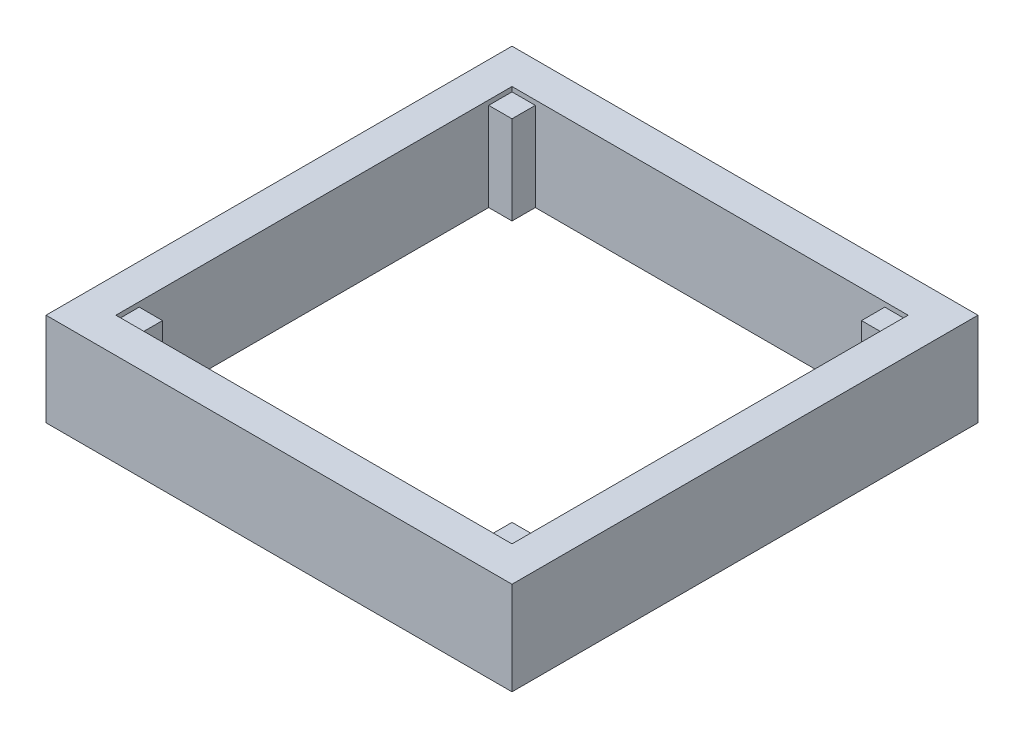
ISO-10303-21;
HEADER;
FILE_DESCRIPTION(('STEP AP214'),'2;1');
FILE_NAME('part.step','',(''),(''),'','','');
FILE_SCHEMA(('AUTOMOTIVE_DESIGN { 1 0 10303 214 1 1 1 1 }'));
ENDSEC;
DATA;
#1=APPLICATION_CONTEXT('core data for automotive mechanical design processes');
#2=APPLICATION_PROTOCOL_DEFINITION('international standard','automotive_design',2000,#1);
#3=PRODUCT_CONTEXT('',#1,'mechanical');
#4=PRODUCT('Part','Part','',(#3));
#5=PRODUCT_RELATED_PRODUCT_CATEGORY('part','',(#4));
#6=PRODUCT_DEFINITION_FORMATION('','',#4);
#7=PRODUCT_DEFINITION_CONTEXT('part definition',#1,'design');
#8=PRODUCT_DEFINITION('design','',#6,#7);
#9=PRODUCT_DEFINITION_SHAPE('','',#8);
#10=(LENGTH_UNIT() NAMED_UNIT(*) SI_UNIT(.MILLI.,.METRE.));
#11=(NAMED_UNIT(*) PLANE_ANGLE_UNIT() SI_UNIT($,.RADIAN.));
#12=(NAMED_UNIT(*) SI_UNIT($,.STERADIAN.) SOLID_ANGLE_UNIT());
#13=UNCERTAINTY_MEASURE_WITH_UNIT(LENGTH_MEASURE(1.E-05),#10,'distance_accuracy_value','');
#14=(GEOMETRIC_REPRESENTATION_CONTEXT(3) GLOBAL_UNCERTAINTY_ASSIGNED_CONTEXT((#13)) GLOBAL_UNIT_ASSIGNED_CONTEXT((#10,
#11,#12)) REPRESENTATION_CONTEXT('',''));
#15=CARTESIAN_POINT('',(0.,0.,0.));
#16=DIRECTION('',(0.,0.,1.));
#17=DIRECTION('',(1.,0.,0.));
#18=AXIS2_PLACEMENT_3D('',#15,#16,#17);
#19=CARTESIAN_POINT('',(107.95,50.8,-107.95));
#20=DIRECTION('',(-1.,0.,0.));
#21=DIRECTION('',(0.,0.,1.));
#22=AXIS2_PLACEMENT_3D('',#19,#20,#21);
#23=PLANE('',#22);
#24=DIRECTION('',(0.,0.,-1.));
#25=VECTOR('',#24,1.);
#26=CARTESIAN_POINT('',(107.95,48.26,-95.25));
#27=LINE('',#26,#25);
#28=CARTESIAN_POINT('',(107.95,48.26,-95.25));
#29=VERTEX_POINT('',#28);
#30=CARTESIAN_POINT('',(107.95,48.26,-107.95));
#31=VERTEX_POINT('',#30);
#32=EDGE_CURVE('E52',#29,#31,#27,.T.);
#33=ORIENTED_EDGE('',*,*,#32,.F.);
#34=DIRECTION('',(0.,-1.,0.));
#35=VECTOR('',#34,1.);
#36=CARTESIAN_POINT('',(107.95,68.7605122421383,-95.25));
#37=LINE('',#36,#35);
#38=CARTESIAN_POINT('',(107.95,0.,-95.25));
#39=VERTEX_POINT('',#38);
#40=EDGE_CURVE('E56',#29,#39,#37,.T.);
#41=ORIENTED_EDGE('',*,*,#40,.T.);
#42=DIRECTION('',(0.,0.,-1.));
#43=VECTOR('',#42,1.);
#44=CARTESIAN_POINT('',(107.95,0.,-107.95));
#45=LINE('',#44,#43);
#46=CARTESIAN_POINT('',(107.95,0.,95.25));
#47=VERTEX_POINT('',#46);
#48=EDGE_CURVE('E265',#47,#39,#45,.T.);
#49=ORIENTED_EDGE('',*,*,#48,.F.);
#50=DIRECTION('',(0.,-1.,0.));
#51=VECTOR('',#50,1.);
#52=CARTESIAN_POINT('',(107.95,68.7605122421383,95.25));
#53=LINE('',#52,#51);
#54=CARTESIAN_POINT('',(107.95,48.26,95.25));
#55=VERTEX_POINT('',#54);
#56=EDGE_CURVE('E251',#55,#47,#53,.T.);
#57=ORIENTED_EDGE('',*,*,#56,.F.);
#58=DIRECTION('',(0.,0.,1.));
#59=VECTOR('',#58,1.);
#60=CARTESIAN_POINT('',(107.95,48.26,95.25));
#61=LINE('',#60,#59);
#62=CARTESIAN_POINT('',(107.95,48.26,107.95));
#63=VERTEX_POINT('',#62);
#64=EDGE_CURVE('E259',#55,#63,#61,.T.);
#65=ORIENTED_EDGE('',*,*,#64,.T.);
#66=DIRECTION('',(0.,-1.,0.));
#67=VECTOR('',#66,1.);
#68=CARTESIAN_POINT('',(107.95,50.8,107.95));
#69=LINE('',#68,#67);
#70=CARTESIAN_POINT('',(107.95,50.8,107.95));
#71=VERTEX_POINT('',#70);
#72=EDGE_CURVE('E269',#71,#63,#69,.T.);
#73=ORIENTED_EDGE('',*,*,#72,.F.);
#74=DIRECTION('',(0.,0.,-1.));
#75=VECTOR('',#74,1.);
#76=CARTESIAN_POINT('',(107.95,50.8,-107.95));
#77=LINE('',#76,#75);
#78=CARTESIAN_POINT('',(107.95,50.8,-107.95));
#79=VERTEX_POINT('',#78);
#80=EDGE_CURVE('E266',#71,#79,#77,.T.);
#81=ORIENTED_EDGE('',*,*,#80,.T.);
#82=DIRECTION('',(0.,-1.,0.));
#83=VECTOR('',#82,1.);
#84=CARTESIAN_POINT('',(107.95,50.8,-107.95));
#85=LINE('',#84,#83);
#86=EDGE_CURVE('E273',#79,#31,#85,.T.);
#87=ORIENTED_EDGE('',*,*,#86,.T.);
#88=EDGE_LOOP('',(#33,#41,#49,#57,#65,#73,#81,#87));
#89=FACE_BOUND('',#88,.T.);
#90=ADVANCED_FACE('F34',(#89),#23,.T.);
#91=CARTESIAN_POINT('',(-127.,305.513373225671,-107.95));
#92=DIRECTION('',(0.,0.,1.));
#93=DIRECTION('',(1.,0.,0.));
#94=AXIS2_PLACEMENT_3D('',#91,#92,#93);
#95=PLANE('',#94);
#96=DIRECTION('',(-1.,0.,0.));
#97=VECTOR('',#96,1.);
#98=CARTESIAN_POINT('',(-127.,0.,-107.95));
#99=LINE('',#98,#97);
#100=CARTESIAN_POINT('',(95.25,0.,-107.95));
#101=VERTEX_POINT('',#100);
#102=CARTESIAN_POINT('',(-95.25,0.,-107.95));
#103=VERTEX_POINT('',#102);
#104=EDGE_CURVE('E228',#101,#103,#99,.T.);
#105=ORIENTED_EDGE('',*,*,#104,.F.);
#106=DIRECTION('',(0.,-1.,0.));
#107=VECTOR('',#106,1.);
#108=CARTESIAN_POINT('',(95.25,68.7605122421383,-107.95));
#109=LINE('',#108,#107);
#110=CARTESIAN_POINT('',(95.25,48.26,-107.95));
#111=VERTEX_POINT('',#110);
#112=EDGE_CURVE('E199',#111,#101,#109,.T.);
#113=ORIENTED_EDGE('',*,*,#112,.F.);
#114=DIRECTION('',(-1.,0.,0.));
#115=VECTOR('',#114,1.);
#116=CARTESIAN_POINT('',(95.25,48.26,-107.95));
#117=LINE('',#116,#115);
#118=EDGE_CURVE('E193',#31,#111,#117,.T.);
#119=ORIENTED_EDGE('',*,*,#118,.F.);
#120=ORIENTED_EDGE('',*,*,#86,.F.);
#121=DIRECTION('',(-1.,0.,0.));
#122=VECTOR('',#121,1.);
#123=CARTESIAN_POINT('',(-127.,50.8,-107.95));
#124=LINE('',#123,#122);
#125=CARTESIAN_POINT('',(-107.95,50.8,-107.95));
#126=VERTEX_POINT('',#125);
#127=EDGE_CURVE('E234',#79,#126,#124,.T.);
#128=ORIENTED_EDGE('',*,*,#127,.T.);
#129=DIRECTION('',(0.,-1.,0.));
#130=VECTOR('',#129,1.);
#131=CARTESIAN_POINT('',(-107.95,50.8,-107.95));
#132=LINE('',#131,#130);
#133=CARTESIAN_POINT('',(-107.95,48.26,-107.95));
#134=VERTEX_POINT('',#133);
#135=EDGE_CURVE('E44',#126,#134,#132,.T.);
#136=ORIENTED_EDGE('',*,*,#135,.T.);
#137=DIRECTION('',(1.,0.,0.));
#138=VECTOR('',#137,1.);
#139=CARTESIAN_POINT('',(-95.25,48.26,-107.95));
#140=LINE('',#139,#138);
#141=CARTESIAN_POINT('',(-95.25,48.26,-107.95));
#142=VERTEX_POINT('',#141);
#143=EDGE_CURVE('E216',#134,#142,#140,.T.);
#144=ORIENTED_EDGE('',*,*,#143,.T.);
#145=DIRECTION('',(0.,-1.,0.));
#146=VECTOR('',#145,1.);
#147=CARTESIAN_POINT('',(-95.25,68.7605122421383,-107.95));
#148=LINE('',#147,#146);
#149=EDGE_CURVE('E215',#142,#103,#148,.T.);
#150=ORIENTED_EDGE('',*,*,#149,.T.);
#151=EDGE_LOOP('',(#105,#113,#119,#120,#128,#136,#144,#150));
#152=FACE_BOUND('',#151,.T.);
#153=ADVANCED_FACE('F368',(#152),#95,.T.);
#154=CARTESIAN_POINT('',(-107.95,50.8,-107.95));
#155=DIRECTION('',(-1.,0.,0.));
#156=DIRECTION('',(0.,0.,1.));
#157=AXIS2_PLACEMENT_3D('',#154,#155,#156);
#158=PLANE('',#157);
#159=DIRECTION('',(0.,-1.,0.));
#160=VECTOR('',#159,1.);
#161=CARTESIAN_POINT('',(-107.95,68.7605122421383,-95.25));
#162=LINE('',#161,#160);
#163=CARTESIAN_POINT('',(-107.95,48.26,-95.25));
#164=VERTEX_POINT('',#163);
#165=CARTESIAN_POINT('',(-107.95,0.,-95.25));
#166=VERTEX_POINT('',#165);
#167=EDGE_CURVE('E210',#164,#166,#162,.T.);
#168=ORIENTED_EDGE('',*,*,#167,.F.);
#169=DIRECTION('',(0.,0.,-1.));
#170=VECTOR('',#169,1.);
#171=CARTESIAN_POINT('',(-107.95,48.26,-95.25));
#172=LINE('',#171,#170);
#173=EDGE_CURVE('E218',#164,#134,#172,.T.);
#174=ORIENTED_EDGE('',*,*,#173,.T.);
#175=ORIENTED_EDGE('',*,*,#135,.F.);
#176=DIRECTION('',(0.,0.,-1.));
#177=VECTOR('',#176,1.);
#178=CARTESIAN_POINT('',(-107.95,50.8,-107.95));
#179=LINE('',#178,#177);
#180=CARTESIAN_POINT('',(-107.95,50.8,107.95));
#181=VERTEX_POINT('',#180);
#182=EDGE_CURVE('E326',#181,#126,#179,.T.);
#183=ORIENTED_EDGE('',*,*,#182,.F.);
#184=DIRECTION('',(0.,-1.,0.));
#185=VECTOR('',#184,1.);
#186=CARTESIAN_POINT('',(-107.95,50.8,107.95));
#187=LINE('',#186,#185);
#188=CARTESIAN_POINT('',(-107.95,48.26,107.95));
#189=VERTEX_POINT('',#188);
#190=EDGE_CURVE('E12',#181,#189,#187,.T.);
#191=ORIENTED_EDGE('',*,*,#190,.T.);
#192=DIRECTION('',(0.,0.,1.));
#193=VECTOR('',#192,1.);
#194=CARTESIAN_POINT('',(-107.95,48.26,95.25));
#195=LINE('',#194,#193);
#196=CARTESIAN_POINT('',(-107.95,48.26,95.25));
#197=VERTEX_POINT('',#196);
#198=EDGE_CURVE('E283',#197,#189,#195,.T.);
#199=ORIENTED_EDGE('',*,*,#198,.F.);
#200=DIRECTION('',(0.,-1.,0.));
#201=VECTOR('',#200,1.);
#202=CARTESIAN_POINT('',(-107.95,68.7605122421383,95.25));
#203=LINE('',#202,#201);
#204=CARTESIAN_POINT('',(-107.95,0.,95.25));
#205=VERTEX_POINT('',#204);
#206=EDGE_CURVE('E278',#197,#205,#203,.T.);
#207=ORIENTED_EDGE('',*,*,#206,.T.);
#208=DIRECTION('',(0.,0.,-1.));
#209=VECTOR('',#208,1.);
#210=CARTESIAN_POINT('',(-107.95,0.,-107.95));
#211=LINE('',#210,#209);
#212=EDGE_CURVE('E318',#205,#166,#211,.T.);
#213=ORIENTED_EDGE('',*,*,#212,.T.);
#214=EDGE_LOOP('',(#168,#174,#175,#183,#191,#199,#207,#213));
#215=FACE_BOUND('',#214,.T.);
#216=ADVANCED_FACE('F373',(#215),#158,.F.);
#217=CARTESIAN_POINT('',(-127.,305.513373225671,107.95));
#218=DIRECTION('',(0.,0.,1.));
#219=DIRECTION('',(1.,0.,0.));
#220=AXIS2_PLACEMENT_3D('',#217,#218,#219);
#221=PLANE('',#220);
#222=ORIENTED_EDGE('',*,*,#72,.T.);
#223=DIRECTION('',(-1.,0.,0.));
#224=VECTOR('',#223,1.);
#225=CARTESIAN_POINT('',(95.25,48.26,107.95));
#226=LINE('',#225,#224);
#227=CARTESIAN_POINT('',(95.25,48.26,107.95));
#228=VERTEX_POINT('',#227);
#229=EDGE_CURVE('E257',#63,#228,#226,.T.);
#230=ORIENTED_EDGE('',*,*,#229,.T.);
#231=DIRECTION('',(0.,-1.,0.));
#232=VECTOR('',#231,1.);
#233=CARTESIAN_POINT('',(95.25,68.7605122421383,107.95));
#234=LINE('',#233,#232);
#235=CARTESIAN_POINT('',(95.25,0.,107.95));
#236=VERTEX_POINT('',#235);
#237=EDGE_CURVE('E256',#228,#236,#234,.T.);
#238=ORIENTED_EDGE('',*,*,#237,.T.);
#239=DIRECTION('',(-1.,0.,0.));
#240=VECTOR('',#239,1.);
#241=CARTESIAN_POINT('',(-127.,0.,107.95));
#242=LINE('',#241,#240);
#243=CARTESIAN_POINT('',(-95.25,0.,107.95));
#244=VERTEX_POINT('',#243);
#245=EDGE_CURVE('E38',#236,#244,#242,.T.);
#246=ORIENTED_EDGE('',*,*,#245,.T.);
#247=DIRECTION('',(0.,-1.,0.));
#248=VECTOR('',#247,1.);
#249=CARTESIAN_POINT('',(-95.25,68.7605122421383,107.95));
#250=LINE('',#249,#248);
#251=CARTESIAN_POINT('',(-95.25,48.26,107.95));
#252=VERTEX_POINT('',#251);
#253=EDGE_CURVE('E275',#252,#244,#250,.T.);
#254=ORIENTED_EDGE('',*,*,#253,.F.);
#255=DIRECTION('',(1.,0.,0.));
#256=VECTOR('',#255,1.);
#257=CARTESIAN_POINT('',(-95.25,48.26,107.95));
#258=LINE('',#257,#256);
#259=EDGE_CURVE('E292',#189,#252,#258,.T.);
#260=ORIENTED_EDGE('',*,*,#259,.F.);
#261=ORIENTED_EDGE('',*,*,#190,.F.);
#262=DIRECTION('',(-1.,0.,0.));
#263=VECTOR('',#262,1.);
#264=CARTESIAN_POINT('',(-127.,50.8,107.95));
#265=LINE('',#264,#263);
#266=EDGE_CURVE('E313',#71,#181,#265,.T.);
#267=ORIENTED_EDGE('',*,*,#266,.F.);
#268=EDGE_LOOP('',(#222,#230,#238,#246,#254,#260,#261,#267));
#269=FACE_BOUND('',#268,.T.);
#270=ADVANCED_FACE('F365',(#269),#221,.F.);
#271=CARTESIAN_POINT('',(-127.,50.8,-107.95));
#272=DIRECTION('',(1.,0.,0.));
#273=DIRECTION('',(0.,0.,-1.));
#274=AXIS2_PLACEMENT_3D('',#271,#272,#273);
#275=PLANE('',#274);
#276=DIRECTION('',(0.,0.,1.));
#277=VECTOR('',#276,1.);
#278=CARTESIAN_POINT('',(-127.,0.,-107.95));
#279=LINE('',#278,#277);
#280=CARTESIAN_POINT('',(-127.,0.,-127.));
#281=VERTEX_POINT('',#280);
#282=CARTESIAN_POINT('',(-127.,0.,127.));
#283=VERTEX_POINT('',#282);
#284=EDGE_CURVE('E309',#281,#283,#279,.T.);
#285=ORIENTED_EDGE('',*,*,#284,.T.);
#286=DIRECTION('',(0.,-1.,0.));
#287=VECTOR('',#286,1.);
#288=CARTESIAN_POINT('',(-127.,305.513373225671,127.));
#289=LINE('',#288,#287);
#290=CARTESIAN_POINT('',(-127.,50.8,127.));
#291=VERTEX_POINT('',#290);
#292=EDGE_CURVE('E285',#291,#283,#289,.T.);
#293=ORIENTED_EDGE('',*,*,#292,.F.);
#294=DIRECTION('',(0.,0.,1.));
#295=VECTOR('',#294,1.);
#296=CARTESIAN_POINT('',(-127.,50.8,-107.95));
#297=LINE('',#296,#295);
#298=CARTESIAN_POINT('',(-127.,50.8,-127.));
#299=VERTEX_POINT('',#298);
#300=EDGE_CURVE('E321',#299,#291,#297,.T.);
#301=ORIENTED_EDGE('',*,*,#300,.F.);
#302=DIRECTION('',(0.,-1.,0.));
#303=VECTOR('',#302,1.);
#304=CARTESIAN_POINT('',(-127.,305.513373225671,-127.));
#305=LINE('',#304,#303);
#306=EDGE_CURVE('E237',#299,#281,#305,.T.);
#307=ORIENTED_EDGE('',*,*,#306,.T.);
#308=EDGE_LOOP('',(#285,#293,#301,#307));
#309=FACE_BOUND('',#308,.T.);
#310=ADVANCED_FACE('F36',(#309),#275,.F.);
#311=CARTESIAN_POINT('',(0.,50.8,0.));
#312=DIRECTION('',(0.,1.,0.));
#313=DIRECTION('',(0.,0.,1.));
#314=AXIS2_PLACEMENT_3D('',#311,#312,#313);
#315=PLANE('',#314);
#316=ORIENTED_EDGE('',*,*,#266,.T.);
#317=ORIENTED_EDGE('',*,*,#182,.T.);
#318=ORIENTED_EDGE('',*,*,#127,.F.);
#319=ORIENTED_EDGE('',*,*,#80,.F.);
#320=EDGE_LOOP('',(#316,#317,#318,#319));
#321=FACE_BOUND('',#320,.T.);
#322=ORIENTED_EDGE('',*,*,#300,.T.);
#323=DIRECTION('',(1.,0.,0.));
#324=VECTOR('',#323,1.);
#325=CARTESIAN_POINT('',(-127.,50.8,127.));
#326=LINE('',#325,#324);
#327=CARTESIAN_POINT('',(127.,50.8,127.));
#328=VERTEX_POINT('',#327);
#329=EDGE_CURVE('E310',#291,#328,#326,.T.);
#330=ORIENTED_EDGE('',*,*,#329,.T.);
#331=DIRECTION('',(0.,0.,-1.));
#332=VECTOR('',#331,1.);
#333=CARTESIAN_POINT('',(127.,50.8,107.95));
#334=LINE('',#333,#332);
#335=CARTESIAN_POINT('',(127.,50.8,-127.));
#336=VERTEX_POINT('',#335);
#337=EDGE_CURVE('E307',#328,#336,#334,.T.);
#338=ORIENTED_EDGE('',*,*,#337,.T.);
#339=DIRECTION('',(1.,0.,0.));
#340=VECTOR('',#339,1.);
#341=CARTESIAN_POINT('',(-127.,50.8,-127.));
#342=LINE('',#341,#340);
#343=EDGE_CURVE('E230',#299,#336,#342,.T.);
#344=ORIENTED_EDGE('',*,*,#343,.F.);
#345=EDGE_LOOP('',(#322,#330,#338,#344));
#346=FACE_BOUND('',#345,.T.);
#347=ADVANCED_FACE('F356',(#321,#346),#315,.T.);
#348=CARTESIAN_POINT('',(0.,0.,0.));
#349=DIRECTION('',(0.,1.,0.));
#350=DIRECTION('',(0.,0.,1.));
#351=AXIS2_PLACEMENT_3D('',#348,#349,#350);
#352=PLANE('',#351);
#353=ORIENTED_EDGE('',*,*,#212,.F.);
#354=DIRECTION('',(-1.,0.,0.));
#355=VECTOR('',#354,1.);
#356=CARTESIAN_POINT('',(-95.25,0.,95.25));
#357=LINE('',#356,#355);
#358=CARTESIAN_POINT('',(-95.25,0.,95.25));
#359=VERTEX_POINT('',#358);
#360=EDGE_CURVE('E276',#359,#205,#357,.T.);
#361=ORIENTED_EDGE('',*,*,#360,.F.);
#362=DIRECTION('',(0.,0.,-1.));
#363=VECTOR('',#362,1.);
#364=CARTESIAN_POINT('',(-95.25,0.,95.25));
#365=LINE('',#364,#363);
#366=EDGE_CURVE('E280',#244,#359,#365,.T.);
#367=ORIENTED_EDGE('',*,*,#366,.F.);
#368=ORIENTED_EDGE('',*,*,#245,.F.);
#369=DIRECTION('',(0.,0.,-1.));
#370=VECTOR('',#369,1.);
#371=CARTESIAN_POINT('',(95.25,0.,95.25));
#372=LINE('',#371,#370);
#373=CARTESIAN_POINT('',(95.25,0.,95.25));
#374=VERTEX_POINT('',#373);
#375=EDGE_CURVE('E242',#236,#374,#372,.T.);
#376=ORIENTED_EDGE('',*,*,#375,.T.);
#377=DIRECTION('',(1.,0.,0.));
#378=VECTOR('',#377,1.);
#379=CARTESIAN_POINT('',(95.25,0.,95.25));
#380=LINE('',#379,#378);
#381=EDGE_CURVE('E243',#374,#47,#380,.T.);
#382=ORIENTED_EDGE('',*,*,#381,.T.);
#383=ORIENTED_EDGE('',*,*,#48,.T.);
#384=DIRECTION('',(1.,0.,0.));
#385=VECTOR('',#384,1.);
#386=CARTESIAN_POINT('',(95.25,0.,-95.25));
#387=LINE('',#386,#385);
#388=CARTESIAN_POINT('',(95.25,0.,-95.25));
#389=VERTEX_POINT('',#388);
#390=EDGE_CURVE('E190',#389,#39,#387,.T.);
#391=ORIENTED_EDGE('',*,*,#390,.F.);
#392=DIRECTION('',(0.,0.,1.));
#393=VECTOR('',#392,1.);
#394=CARTESIAN_POINT('',(95.25,0.,-95.25));
#395=LINE('',#394,#393);
#396=EDGE_CURVE('E189',#101,#389,#395,.T.);
#397=ORIENTED_EDGE('',*,*,#396,.F.);
#398=ORIENTED_EDGE('',*,*,#104,.T.);
#399=DIRECTION('',(0.,0.,1.));
#400=VECTOR('',#399,1.);
#401=CARTESIAN_POINT('',(-95.25,0.,-95.25));
#402=LINE('',#401,#400);
#403=CARTESIAN_POINT('',(-95.25,0.,-95.25));
#404=VERTEX_POINT('',#403);
#405=EDGE_CURVE('E205',#103,#404,#402,.T.);
#406=ORIENTED_EDGE('',*,*,#405,.T.);
#407=DIRECTION('',(-1.,0.,0.));
#408=VECTOR('',#407,1.);
#409=CARTESIAN_POINT('',(-95.25,0.,-95.25));
#410=LINE('',#409,#408);
#411=EDGE_CURVE('E201',#404,#166,#410,.T.);
#412=ORIENTED_EDGE('',*,*,#411,.T.);
#413=EDGE_LOOP('',(#353,#361,#367,#368,#376,#382,#383,#391,#397,#398,#406,#412));
#414=FACE_BOUND('',#413,.T.);
#415=DIRECTION('',(1.,0.,0.));
#416=VECTOR('',#415,1.);
#417=CARTESIAN_POINT('',(-127.,0.,127.));
#418=LINE('',#417,#416);
#419=CARTESIAN_POINT('',(127.,0.,127.));
#420=VERTEX_POINT('',#419);
#421=EDGE_CURVE('E304',#283,#420,#418,.T.);
#422=ORIENTED_EDGE('',*,*,#421,.F.);
#423=ORIENTED_EDGE('',*,*,#284,.F.);
#424=DIRECTION('',(1.,0.,0.));
#425=VECTOR('',#424,1.);
#426=CARTESIAN_POINT('',(-127.,0.,-127.));
#427=LINE('',#426,#425);
#428=CARTESIAN_POINT('',(127.,0.,-127.));
#429=VERTEX_POINT('',#428);
#430=EDGE_CURVE('E225',#281,#429,#427,.T.);
#431=ORIENTED_EDGE('',*,*,#430,.T.);
#432=DIRECTION('',(0.,0.,-1.));
#433=VECTOR('',#432,1.);
#434=CARTESIAN_POINT('',(127.,0.,107.95));
#435=LINE('',#434,#433);
#436=EDGE_CURVE('E301',#420,#429,#435,.T.);
#437=ORIENTED_EDGE('',*,*,#436,.F.);
#438=EDGE_LOOP('',(#422,#423,#431,#437));
#439=FACE_BOUND('',#438,.T.);
#440=ADVANCED_FACE('F350',(#414,#439),#352,.F.);
#441=CARTESIAN_POINT('',(-127.,305.513373225671,127.));
#442=DIRECTION('',(0.,0.,-1.));
#443=DIRECTION('',(-1.,0.,0.));
#444=AXIS2_PLACEMENT_3D('',#441,#442,#443);
#445=PLANE('',#444);
#446=ORIENTED_EDGE('',*,*,#329,.F.);
#447=ORIENTED_EDGE('',*,*,#292,.T.);
#448=ORIENTED_EDGE('',*,*,#421,.T.);
#449=DIRECTION('',(0.,-1.,0.));
#450=VECTOR('',#449,1.);
#451=CARTESIAN_POINT('',(127.,305.513373225671,127.));
#452=LINE('',#451,#450);
#453=EDGE_CURVE('E303',#328,#420,#452,.T.);
#454=ORIENTED_EDGE('',*,*,#453,.F.);
#455=EDGE_LOOP('',(#446,#447,#448,#454));
#456=FACE_BOUND('',#455,.T.);
#457=ADVANCED_FACE('F347',(#456),#445,.F.);
#458=CARTESIAN_POINT('',(127.,305.513373225671,107.95));
#459=DIRECTION('',(-1.,0.,0.));
#460=DIRECTION('',(0.,0.,1.));
#461=AXIS2_PLACEMENT_3D('',#458,#459,#460);
#462=PLANE('',#461);
#463=ORIENTED_EDGE('',*,*,#436,.T.);
#464=DIRECTION('',(0.,-1.,0.));
#465=VECTOR('',#464,1.);
#466=CARTESIAN_POINT('',(127.,305.513373225671,-127.));
#467=LINE('',#466,#465);
#468=EDGE_CURVE('E233',#336,#429,#467,.T.);
#469=ORIENTED_EDGE('',*,*,#468,.F.);
#470=ORIENTED_EDGE('',*,*,#337,.F.);
#471=ORIENTED_EDGE('',*,*,#453,.T.);
#472=EDGE_LOOP('',(#463,#469,#470,#471));
#473=FACE_BOUND('',#472,.T.);
#474=ADVANCED_FACE('F353',(#473),#462,.F.);
#475=CARTESIAN_POINT('',(-95.25,68.7605122421383,95.25));
#476=DIRECTION('',(-1.,0.,0.));
#477=DIRECTION('',(0.,0.,1.));
#478=AXIS2_PLACEMENT_3D('',#475,#476,#477);
#479=PLANE('',#478);
#480=DIRECTION('',(0.,0.,-1.));
#481=VECTOR('',#480,1.);
#482=CARTESIAN_POINT('',(-95.25,48.26,95.25));
#483=LINE('',#482,#481);
#484=CARTESIAN_POINT('',(-95.25,48.26,95.25));
#485=VERTEX_POINT('',#484);
#486=EDGE_CURVE('E289',#252,#485,#483,.T.);
#487=ORIENTED_EDGE('',*,*,#486,.F.);
#488=ORIENTED_EDGE('',*,*,#253,.T.);
#489=ORIENTED_EDGE('',*,*,#366,.T.);
#490=DIRECTION('',(0.,-1.,0.));
#491=VECTOR('',#490,1.);
#492=CARTESIAN_POINT('',(-95.25,68.7605122421383,95.25));
#493=LINE('',#492,#491);
#494=EDGE_CURVE('E279',#485,#359,#493,.T.);
#495=ORIENTED_EDGE('',*,*,#494,.F.);
#496=EDGE_LOOP('',(#487,#488,#489,#495));
#497=FACE_BOUND('',#496,.T.);
#498=ADVANCED_FACE('F384',(#497),#479,.F.);
#499=CARTESIAN_POINT('',(-95.25,68.7605122421383,95.25));
#500=DIRECTION('',(0.,0.,1.));
#501=DIRECTION('',(1.,0.,0.));
#502=AXIS2_PLACEMENT_3D('',#499,#500,#501);
#503=PLANE('',#502);
#504=DIRECTION('',(-1.,0.,0.));
#505=VECTOR('',#504,1.);
#506=CARTESIAN_POINT('',(-95.25,48.26,95.25));
#507=LINE('',#506,#505);
#508=EDGE_CURVE('E286',#485,#197,#507,.T.);
#509=ORIENTED_EDGE('',*,*,#508,.F.);
#510=ORIENTED_EDGE('',*,*,#494,.T.);
#511=ORIENTED_EDGE('',*,*,#360,.T.);
#512=ORIENTED_EDGE('',*,*,#206,.F.);
#513=EDGE_LOOP('',(#509,#510,#511,#512));
#514=FACE_BOUND('',#513,.T.);
#515=ADVANCED_FACE('F380',(#514),#503,.F.);
#516=CARTESIAN_POINT('',(0.,48.26,0.));
#517=DIRECTION('',(0.,1.,0.));
#518=DIRECTION('',(0.,0.,1.));
#519=AXIS2_PLACEMENT_3D('',#516,#517,#518);
#520=PLANE('',#519);
#521=ORIENTED_EDGE('',*,*,#259,.T.);
#522=ORIENTED_EDGE('',*,*,#486,.T.);
#523=ORIENTED_EDGE('',*,*,#508,.T.);
#524=ORIENTED_EDGE('',*,*,#198,.T.);
#525=EDGE_LOOP('',(#521,#522,#523,#524));
#526=FACE_BOUND('',#525,.T.);
#527=ADVANCED_FACE('F383',(#526),#520,.T.);
#528=CARTESIAN_POINT('',(0.,48.26,0.));
#529=DIRECTION('',(0.,1.,0.));
#530=DIRECTION('',(0.,0.,1.));
#531=AXIS2_PLACEMENT_3D('',#528,#529,#530);
#532=PLANE('',#531);
#533=DIRECTION('',(0.,0.,-1.));
#534=VECTOR('',#533,1.);
#535=CARTESIAN_POINT('',(95.25,48.26,95.25));
#536=LINE('',#535,#534);
#537=CARTESIAN_POINT('',(95.25,48.26,95.25));
#538=VERTEX_POINT('',#537);
#539=EDGE_CURVE('E252',#228,#538,#536,.T.);
#540=ORIENTED_EDGE('',*,*,#539,.F.);
#541=ORIENTED_EDGE('',*,*,#229,.F.);
#542=ORIENTED_EDGE('',*,*,#64,.F.);
#543=DIRECTION('',(1.,0.,0.));
#544=VECTOR('',#543,1.);
#545=CARTESIAN_POINT('',(95.25,48.26,95.25));
#546=LINE('',#545,#544);
#547=EDGE_CURVE('E246',#538,#55,#546,.T.);
#548=ORIENTED_EDGE('',*,*,#547,.F.);
#549=EDGE_LOOP('',(#540,#541,#542,#548));
#550=FACE_BOUND('',#549,.T.);
#551=ADVANCED_FACE('F378',(#550),#532,.T.);
#552=CARTESIAN_POINT('',(95.25,68.7605122421383,95.25));
#553=DIRECTION('',(0.,0.,-1.));
#554=DIRECTION('',(-1.,0.,0.));
#555=AXIS2_PLACEMENT_3D('',#552,#553,#554);
#556=PLANE('',#555);
#557=DIRECTION('',(0.,-1.,0.));
#558=VECTOR('',#557,1.);
#559=CARTESIAN_POINT('',(95.25,68.7605122421383,95.25));
#560=LINE('',#559,#558);
#561=EDGE_CURVE('E255',#538,#374,#560,.T.);
#562=ORIENTED_EDGE('',*,*,#561,.F.);
#563=ORIENTED_EDGE('',*,*,#547,.T.);
#564=ORIENTED_EDGE('',*,*,#56,.T.);
#565=ORIENTED_EDGE('',*,*,#381,.F.);
#566=EDGE_LOOP('',(#562,#563,#564,#565));
#567=FACE_BOUND('',#566,.T.);
#568=ADVANCED_FACE('F425',(#567),#556,.T.);
#569=CARTESIAN_POINT('',(95.25,68.7605122421383,95.25));
#570=DIRECTION('',(-1.,0.,0.));
#571=DIRECTION('',(0.,0.,1.));
#572=AXIS2_PLACEMENT_3D('',#569,#570,#571);
#573=PLANE('',#572);
#574=ORIENTED_EDGE('',*,*,#237,.F.);
#575=ORIENTED_EDGE('',*,*,#539,.T.);
#576=ORIENTED_EDGE('',*,*,#561,.T.);
#577=ORIENTED_EDGE('',*,*,#375,.F.);
#578=EDGE_LOOP('',(#574,#575,#576,#577));
#579=FACE_BOUND('',#578,.T.);
#580=ADVANCED_FACE('F432',(#579),#573,.T.);
#581=CARTESIAN_POINT('',(-127.,305.513373225671,-127.));
#582=DIRECTION('',(0.,0.,-1.));
#583=DIRECTION('',(-1.,0.,0.));
#584=AXIS2_PLACEMENT_3D('',#581,#582,#583);
#585=PLANE('',#584);
#586=ORIENTED_EDGE('',*,*,#306,.F.);
#587=ORIENTED_EDGE('',*,*,#343,.T.);
#588=ORIENTED_EDGE('',*,*,#468,.T.);
#589=ORIENTED_EDGE('',*,*,#430,.F.);
#590=EDGE_LOOP('',(#586,#587,#588,#589));
#591=FACE_BOUND('',#590,.T.);
#592=ADVANCED_FACE('F355',(#591),#585,.T.);
#593=CARTESIAN_POINT('',(0.,48.26,0.));
#594=DIRECTION('',(0.,1.,0.));
#595=DIRECTION('',(0.,0.,1.));
#596=AXIS2_PLACEMENT_3D('',#593,#594,#595);
#597=PLANE('',#596);
#598=DIRECTION('',(0.,0.,1.));
#599=VECTOR('',#598,1.);
#600=CARTESIAN_POINT('',(-95.25,48.26,-95.25));
#601=LINE('',#600,#599);
#602=CARTESIAN_POINT('',(-95.25,48.26,-95.25));
#603=VERTEX_POINT('',#602);
#604=EDGE_CURVE('E211',#142,#603,#601,.T.);
#605=ORIENTED_EDGE('',*,*,#604,.F.);
#606=ORIENTED_EDGE('',*,*,#143,.F.);
#607=ORIENTED_EDGE('',*,*,#173,.F.);
#608=DIRECTION('',(-1.,0.,0.));
#609=VECTOR('',#608,1.);
#610=CARTESIAN_POINT('',(-95.25,48.26,-95.25));
#611=LINE('',#610,#609);
#612=EDGE_CURVE('E204',#603,#164,#611,.T.);
#613=ORIENTED_EDGE('',*,*,#612,.F.);
#614=EDGE_LOOP('',(#605,#606,#607,#613));
#615=FACE_BOUND('',#614,.T.);
#616=ADVANCED_FACE('F445',(#615),#597,.T.);
#617=CARTESIAN_POINT('',(-95.25,68.7605122421383,-95.25));
#618=DIRECTION('',(0.,0.,1.));
#619=DIRECTION('',(1.,0.,0.));
#620=AXIS2_PLACEMENT_3D('',#617,#618,#619);
#621=PLANE('',#620);
#622=DIRECTION('',(0.,-1.,0.));
#623=VECTOR('',#622,1.);
#624=CARTESIAN_POINT('',(-95.25,68.7605122421383,-95.25));
#625=LINE('',#624,#623);
#626=EDGE_CURVE('E214',#603,#404,#625,.T.);
#627=ORIENTED_EDGE('',*,*,#626,.F.);
#628=ORIENTED_EDGE('',*,*,#612,.T.);
#629=ORIENTED_EDGE('',*,*,#167,.T.);
#630=ORIENTED_EDGE('',*,*,#411,.F.);
#631=EDGE_LOOP('',(#627,#628,#629,#630));
#632=FACE_BOUND('',#631,.T.);
#633=ADVANCED_FACE('F452',(#632),#621,.T.);
#634=CARTESIAN_POINT('',(-95.25,68.7605122421383,-95.25));
#635=DIRECTION('',(1.,0.,0.));
#636=DIRECTION('',(0.,0.,-1.));
#637=AXIS2_PLACEMENT_3D('',#634,#635,#636);
#638=PLANE('',#637);
#639=ORIENTED_EDGE('',*,*,#149,.F.);
#640=ORIENTED_EDGE('',*,*,#604,.T.);
#641=ORIENTED_EDGE('',*,*,#626,.T.);
#642=ORIENTED_EDGE('',*,*,#405,.F.);
#643=EDGE_LOOP('',(#639,#640,#641,#642));
#644=FACE_BOUND('',#643,.T.);
#645=ADVANCED_FACE('F460',(#644),#638,.T.);
#646=CARTESIAN_POINT('',(95.25,68.7605122421383,-95.25));
#647=DIRECTION('',(1.,0.,0.));
#648=DIRECTION('',(0.,0.,-1.));
#649=AXIS2_PLACEMENT_3D('',#646,#647,#648);
#650=PLANE('',#649);
#651=DIRECTION('',(0.,0.,1.));
#652=VECTOR('',#651,1.);
#653=CARTESIAN_POINT('',(95.25,48.26,-95.25));
#654=LINE('',#653,#652);
#655=CARTESIAN_POINT('',(95.25,48.26,-95.25));
#656=VERTEX_POINT('',#655);
#657=EDGE_CURVE('E180',#111,#656,#654,.T.);
#658=ORIENTED_EDGE('',*,*,#657,.F.);
#659=ORIENTED_EDGE('',*,*,#112,.T.);
#660=ORIENTED_EDGE('',*,*,#396,.T.);
#661=DIRECTION('',(0.,-1.,0.));
#662=VECTOR('',#661,1.);
#663=CARTESIAN_POINT('',(95.25,68.7605122421383,-95.25));
#664=LINE('',#663,#662);
#665=EDGE_CURVE('E176',#656,#389,#664,.T.);
#666=ORIENTED_EDGE('',*,*,#665,.F.);
#667=EDGE_LOOP('',(#658,#659,#660,#666));
#668=FACE_BOUND('',#667,.T.);
#669=ADVANCED_FACE('F185',(#668),#650,.F.);
#670=CARTESIAN_POINT('',(95.25,68.7605122421383,-95.25));
#671=DIRECTION('',(0.,0.,-1.));
#672=DIRECTION('',(-1.,0.,0.));
#673=AXIS2_PLACEMENT_3D('',#670,#671,#672);
#674=PLANE('',#673);
#675=DIRECTION('',(1.,0.,0.));
#676=VECTOR('',#675,1.);
#677=CARTESIAN_POINT('',(95.25,48.26,-95.25));
#678=LINE('',#677,#676);
#679=EDGE_CURVE('E172',#656,#29,#678,.T.);
#680=ORIENTED_EDGE('',*,*,#679,.F.);
#681=ORIENTED_EDGE('',*,*,#665,.T.);
#682=ORIENTED_EDGE('',*,*,#390,.T.);
#683=ORIENTED_EDGE('',*,*,#40,.F.);
#684=EDGE_LOOP('',(#680,#681,#682,#683));
#685=FACE_BOUND('',#684,.T.);
#686=ADVANCED_FACE('F174',(#685),#674,.F.);
#687=CARTESIAN_POINT('',(0.,48.26,0.));
#688=DIRECTION('',(0.,1.,0.));
#689=DIRECTION('',(0.,0.,1.));
#690=AXIS2_PLACEMENT_3D('',#687,#688,#689);
#691=PLANE('',#690);
#692=ORIENTED_EDGE('',*,*,#118,.T.);
#693=ORIENTED_EDGE('',*,*,#657,.T.);
#694=ORIENTED_EDGE('',*,*,#679,.T.);
#695=ORIENTED_EDGE('',*,*,#32,.T.);
#696=EDGE_LOOP('',(#692,#693,#694,#695));
#697=FACE_BOUND('',#696,.T.);
#698=ADVANCED_FACE('F192',(#697),#691,.T.);
#699=CLOSED_SHELL('',(#90,#153,#216,#270,#310,#347,#440,#457,#474,#498,#515,#527,#551,#568,#580,
#592,#616,#633,#645,#669,#686,#698));
#700=MANIFOLD_SOLID_BREP('B2',#699);
#701=ADVANCED_BREP_SHAPE_REPRESENTATION('',(#18,#700),#14);
#702=SHAPE_DEFINITION_REPRESENTATION(#9,#701);
ENDSEC;
END-ISO-10303-21;
